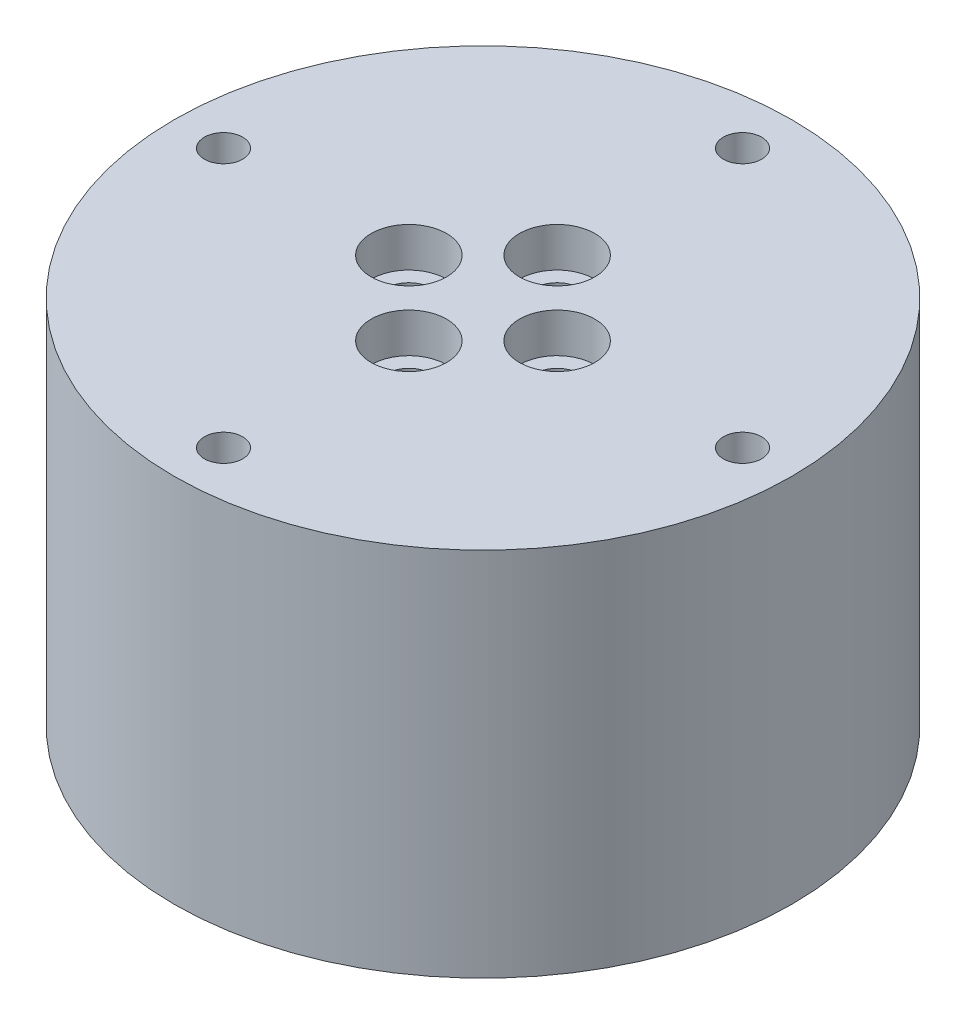
ISO-10303-21;
HEADER;
FILE_DESCRIPTION(('STEP AP214'),'2;1');
FILE_NAME('part.step','',(''),(''),'','','');
FILE_SCHEMA(('AUTOMOTIVE_DESIGN { 1 0 10303 214 1 1 1 1 }'));
ENDSEC;
DATA;
#1=APPLICATION_CONTEXT('core data for automotive mechanical design processes');
#2=APPLICATION_PROTOCOL_DEFINITION('international standard','automotive_design',2000,#1);
#3=PRODUCT_CONTEXT('',#1,'mechanical');
#4=PRODUCT('Part','Part','',(#3));
#5=PRODUCT_RELATED_PRODUCT_CATEGORY('part','',(#4));
#6=PRODUCT_DEFINITION_FORMATION('','',#4);
#7=PRODUCT_DEFINITION_CONTEXT('part definition',#1,'design');
#8=PRODUCT_DEFINITION('design','',#6,#7);
#9=PRODUCT_DEFINITION_SHAPE('','',#8);
#10=(LENGTH_UNIT() NAMED_UNIT(*) SI_UNIT(.MILLI.,.METRE.));
#11=(NAMED_UNIT(*) PLANE_ANGLE_UNIT() SI_UNIT($,.RADIAN.));
#12=(NAMED_UNIT(*) SI_UNIT($,.STERADIAN.) SOLID_ANGLE_UNIT());
#13=UNCERTAINTY_MEASURE_WITH_UNIT(LENGTH_MEASURE(1.E-05),#10,'distance_accuracy_value','');
#14=(GEOMETRIC_REPRESENTATION_CONTEXT(3) GLOBAL_UNCERTAINTY_ASSIGNED_CONTEXT((#13)) GLOBAL_UNIT_ASSIGNED_CONTEXT((#10,
#11,#12)) REPRESENTATION_CONTEXT('',''));
#15=CARTESIAN_POINT('',(0.,0.,0.));
#16=DIRECTION('',(0.,0.,1.));
#17=DIRECTION('',(1.,0.,0.));
#18=AXIS2_PLACEMENT_3D('',#15,#16,#17);
#19=CARTESIAN_POINT('',(0.,-5.,0.));
#20=DIRECTION('',(0.,1.,0.));
#21=DIRECTION('',(0.,0.,1.));
#22=AXIS2_PLACEMENT_3D('',#19,#20,#21);
#23=CYLINDRICAL_SURFACE('',#22,25.);
#24=CARTESIAN_POINT('',(0.,0.,0.));
#25=DIRECTION('',(0.,1.,0.));
#26=DIRECTION('',(0.,0.,1.));
#27=AXIS2_PLACEMENT_3D('',#24,#25,#26);
#28=CIRCLE('',#27,25.);
#29=CARTESIAN_POINT('',(0.,0.,25.));
#30=VERTEX_POINT('',#29);
#31=EDGE_CURVE('E66',#30,#30,#28,.T.);
#32=ORIENTED_EDGE('',*,*,#31,.F.);
#33=EDGE_LOOP('',(#32));
#34=FACE_BOUND('',#33,.T.);
#35=CARTESIAN_POINT('',(0.,-30.,0.));
#36=DIRECTION('',(0.,-1.,0.));
#37=DIRECTION('',(0.,0.,-1.));
#38=AXIS2_PLACEMENT_3D('',#35,#36,#37);
#39=CIRCLE('',#38,25.);
#40=CARTESIAN_POINT('',(0.,-30.,-25.));
#41=VERTEX_POINT('',#40);
#42=EDGE_CURVE('E70',#41,#41,#39,.T.);
#43=ORIENTED_EDGE('',*,*,#42,.F.);
#44=EDGE_LOOP('',(#43));
#45=FACE_BOUND('',#44,.T.);
#46=ADVANCED_FACE('F39',(#34,#45),#23,.T.);
#47=CARTESIAN_POINT('',(0.,0.,0.));
#48=DIRECTION('',(0.,1.,0.));
#49=DIRECTION('',(0.,0.,1.));
#50=AXIS2_PLACEMENT_3D('',#47,#48,#49);
#51=PLANE('',#50);
#52=CARTESIAN_POINT('',(21.,0.,0.));
#53=DIRECTION('',(0.,1.,0.));
#54=DIRECTION('',(-1.,0.,0.));
#55=AXIS2_PLACEMENT_3D('',#52,#53,#54);
#56=CIRCLE('',#55,1.55);
#57=CARTESIAN_POINT('',(19.45,0.,0.));
#58=VERTEX_POINT('',#57);
#59=EDGE_CURVE('E160',#58,#58,#56,.T.);
#60=ORIENTED_EDGE('',*,*,#59,.F.);
#61=EDGE_LOOP('',(#60));
#62=FACE_BOUND('',#61,.T.);
#63=CARTESIAN_POINT('',(0.,0.,21.));
#64=DIRECTION('',(0.,1.,0.));
#65=DIRECTION('',(0.,0.,-1.));
#66=AXIS2_PLACEMENT_3D('',#63,#64,#65);
#67=CIRCLE('',#66,1.55);
#68=CARTESIAN_POINT('',(0.,0.,19.45));
#69=VERTEX_POINT('',#68);
#70=EDGE_CURVE('E153',#69,#69,#67,.T.);
#71=ORIENTED_EDGE('',*,*,#70,.F.);
#72=EDGE_LOOP('',(#71));
#73=FACE_BOUND('',#72,.T.);
#74=CARTESIAN_POINT('',(-21.,0.,-2.19963324347117E-13));
#75=DIRECTION('',(0.,1.,0.));
#76=DIRECTION('',(1.,0.,0.));
#77=AXIS2_PLACEMENT_3D('',#74,#75,#76);
#78=CIRCLE('',#77,1.55);
#79=CARTESIAN_POINT('',(-19.45,0.,-2.03727936121497E-13));
#80=VERTEX_POINT('',#79);
#81=EDGE_CURVE('E146',#80,#80,#78,.T.);
#82=ORIENTED_EDGE('',*,*,#81,.F.);
#83=EDGE_LOOP('',(#82));
#84=FACE_BOUND('',#83,.T.);
#85=CARTESIAN_POINT('',(0.,0.,6.));
#86=DIRECTION('',(0.,1.,0.));
#87=DIRECTION('',(0.,0.,-1.));
#88=AXIS2_PLACEMENT_3D('',#85,#86,#87);
#89=CIRCLE('',#88,3.05);
#90=CARTESIAN_POINT('',(0.,0.,2.95));
#91=VERTEX_POINT('',#90);
#92=EDGE_CURVE('E106',#91,#91,#89,.T.);
#93=ORIENTED_EDGE('',*,*,#92,.F.);
#94=EDGE_LOOP('',(#93));
#95=FACE_BOUND('',#94,.T.);
#96=CARTESIAN_POINT('',(-6.,0.,0.));
#97=DIRECTION('',(0.,1.,0.));
#98=DIRECTION('',(1.,0.,0.));
#99=AXIS2_PLACEMENT_3D('',#96,#97,#98);
#100=CIRCLE('',#99,3.05);
#101=CARTESIAN_POINT('',(-2.95,0.,0.));
#102=VERTEX_POINT('',#101);
#103=EDGE_CURVE('E114',#102,#102,#100,.T.);
#104=ORIENTED_EDGE('',*,*,#103,.F.);
#105=EDGE_LOOP('',(#104));
#106=FACE_BOUND('',#105,.T.);
#107=CARTESIAN_POINT('',(6.,0.,0.));
#108=DIRECTION('',(0.,1.,0.));
#109=DIRECTION('',(-1.,0.,0.));
#110=AXIS2_PLACEMENT_3D('',#107,#108,#109);
#111=CIRCLE('',#110,3.05);
#112=CARTESIAN_POINT('',(2.95,0.,0.));
#113=VERTEX_POINT('',#112);
#114=EDGE_CURVE('E98',#113,#113,#111,.T.);
#115=ORIENTED_EDGE('',*,*,#114,.F.);
#116=EDGE_LOOP('',(#115));
#117=FACE_BOUND('',#116,.T.);
#118=CARTESIAN_POINT('',(0.,0.,-21.));
#119=DIRECTION('',(0.,1.,0.));
#120=DIRECTION('',(0.,0.,1.));
#121=AXIS2_PLACEMENT_3D('',#118,#119,#120);
#122=CIRCLE('',#121,1.55);
#123=CARTESIAN_POINT('',(0.,0.,-19.45));
#124=VERTEX_POINT('',#123);
#125=EDGE_CURVE('E90',#124,#124,#122,.T.);
#126=ORIENTED_EDGE('',*,*,#125,.F.);
#127=EDGE_LOOP('',(#126));
#128=FACE_BOUND('',#127,.T.);
#129=CARTESIAN_POINT('',(0.,0.,-6.));
#130=DIRECTION('',(0.,1.,0.));
#131=DIRECTION('',(0.,0.,1.));
#132=AXIS2_PLACEMENT_3D('',#129,#130,#131);
#133=CIRCLE('',#132,3.05);
#134=CARTESIAN_POINT('',(0.,0.,-2.95));
#135=VERTEX_POINT('',#134);
#136=EDGE_CURVE('E75',#135,#135,#133,.T.);
#137=ORIENTED_EDGE('',*,*,#136,.F.);
#138=EDGE_LOOP('',(#137));
#139=FACE_BOUND('',#138,.T.);
#140=ORIENTED_EDGE('',*,*,#31,.T.);
#141=EDGE_LOOP('',(#140));
#142=FACE_BOUND('',#141,.T.);
#143=ADVANCED_FACE('F177',(#62,#73,#84,#95,#106,#117,#128,#139,#142),#51,.T.);
#144=CARTESIAN_POINT('',(0.,-30.,0.));
#145=DIRECTION('',(0.,-1.,0.));
#146=DIRECTION('',(0.,0.,-1.));
#147=AXIS2_PLACEMENT_3D('',#144,#145,#146);
#148=PLANE('',#147);
#149=CARTESIAN_POINT('',(0.,-30.,0.));
#150=DIRECTION('',(0.,-1.,0.));
#151=DIRECTION('',(0.,0.,-1.));
#152=AXIS2_PLACEMENT_3D('',#149,#150,#151);
#153=CIRCLE('',#152,24.5);
#154=CARTESIAN_POINT('',(0.,-30.,-24.5));
#155=VERTEX_POINT('',#154);
#156=EDGE_CURVE('E54',#155,#155,#153,.F.);
#157=ORIENTED_EDGE('',*,*,#156,.T.);
#158=EDGE_LOOP('',(#157));
#159=FACE_BOUND('',#158,.T.);
#160=ORIENTED_EDGE('',*,*,#42,.T.);
#161=EDGE_LOOP('',(#160));
#162=FACE_BOUND('',#161,.T.);
#163=ADVANCED_FACE('F180',(#159,#162),#148,.T.);
#164=CARTESIAN_POINT('',(0.,-30.,0.));
#165=DIRECTION('',(0.,1.,0.));
#166=DIRECTION('',(0.,0.,1.));
#167=AXIS2_PLACEMENT_3D('',#164,#165,#166);
#168=CYLINDRICAL_SURFACE('',#167,15.5);
#169=CARTESIAN_POINT('',(0.,-7.,0.));
#170=DIRECTION('',(0.,1.,0.));
#171=DIRECTION('',(0.,0.,1.));
#172=AXIS2_PLACEMENT_3D('',#169,#170,#171);
#173=CIRCLE('',#172,15.5);
#174=CARTESIAN_POINT('',(0.,-7.,15.5));
#175=VERTEX_POINT('',#174);
#176=EDGE_CURVE('E10',#175,#175,#173,.T.);
#177=ORIENTED_EDGE('',*,*,#176,.T.);
#178=EDGE_LOOP('',(#177));
#179=FACE_BOUND('',#178,.T.);
#180=CARTESIAN_POINT('',(0.,-21.,0.));
#181=DIRECTION('',(0.,-1.,0.));
#182=DIRECTION('',(0.,0.,-1.));
#183=AXIS2_PLACEMENT_3D('',#180,#181,#182);
#184=CIRCLE('',#183,15.5);
#185=CARTESIAN_POINT('',(0.,-21.,-15.5));
#186=VERTEX_POINT('',#185);
#187=EDGE_CURVE('E60',#186,#186,#184,.T.);
#188=ORIENTED_EDGE('',*,*,#187,.T.);
#189=EDGE_LOOP('',(#188));
#190=FACE_BOUND('',#189,.T.);
#191=ADVANCED_FACE('F204',(#179,#190),#168,.F.);
#192=CARTESIAN_POINT('',(0.,-5.,0.));
#193=DIRECTION('',(0.,1.,0.));
#194=DIRECTION('',(0.,0.,1.));
#195=AXIS2_PLACEMENT_3D('',#192,#193,#194);
#196=PLANE('',#195);
#197=CARTESIAN_POINT('',(0.,-5.,0.));
#198=DIRECTION('',(0.,1.,0.));
#199=DIRECTION('',(0.,0.,1.));
#200=AXIS2_PLACEMENT_3D('',#197,#198,#199);
#201=CIRCLE('',#200,13.5);
#202=CARTESIAN_POINT('',(0.,-5.,13.5));
#203=VERTEX_POINT('',#202);
#204=EDGE_CURVE('E47',#203,#203,#201,.F.);
#205=ORIENTED_EDGE('',*,*,#204,.T.);
#206=EDGE_LOOP('',(#205));
#207=FACE_BOUND('',#206,.T.);
#208=CARTESIAN_POINT('',(6.,-5.,0.));
#209=DIRECTION('',(0.,1.,0.));
#210=DIRECTION('',(0.,0.,1.));
#211=AXIS2_PLACEMENT_3D('',#208,#209,#210);
#212=CIRCLE('',#211,1.8);
#213=CARTESIAN_POINT('',(6.,-5.,1.80000000000002));
#214=VERTEX_POINT('',#213);
#215=EDGE_CURVE('E118',#214,#214,#212,.F.);
#216=ORIENTED_EDGE('',*,*,#215,.F.);
#217=EDGE_LOOP('',(#216));
#218=FACE_BOUND('',#217,.T.);
#219=CARTESIAN_POINT('',(0.,-5.,6.));
#220=DIRECTION('',(0.,1.,0.));
#221=DIRECTION('',(0.,0.,1.));
#222=AXIS2_PLACEMENT_3D('',#219,#220,#221);
#223=CIRCLE('',#222,1.8);
#224=CARTESIAN_POINT('',(0.,-5.,7.8));
#225=VERTEX_POINT('',#224);
#226=EDGE_CURVE('E132',#225,#225,#223,.F.);
#227=ORIENTED_EDGE('',*,*,#226,.F.);
#228=EDGE_LOOP('',(#227));
#229=FACE_BOUND('',#228,.T.);
#230=CARTESIAN_POINT('',(-6.,-5.,0.));
#231=DIRECTION('',(0.,1.,0.));
#232=DIRECTION('',(0.,0.,1.));
#233=AXIS2_PLACEMENT_3D('',#230,#231,#232);
#234=CIRCLE('',#233,1.8);
#235=CARTESIAN_POINT('',(-6.,-5.,1.79999999999994));
#236=VERTEX_POINT('',#235);
#237=EDGE_CURVE('E122',#236,#236,#234,.F.);
#238=ORIENTED_EDGE('',*,*,#237,.F.);
#239=EDGE_LOOP('',(#238));
#240=FACE_BOUND('',#239,.T.);
#241=CARTESIAN_POINT('',(0.,-5.,-6.));
#242=DIRECTION('',(0.,1.,0.));
#243=DIRECTION('',(0.,0.,1.));
#244=AXIS2_PLACEMENT_3D('',#241,#242,#243);
#245=CIRCLE('',#244,1.8);
#246=CARTESIAN_POINT('',(0.,-5.,-4.2));
#247=VERTEX_POINT('',#246);
#248=EDGE_CURVE('E78',#247,#247,#245,.F.);
#249=ORIENTED_EDGE('',*,*,#248,.F.);
#250=EDGE_LOOP('',(#249));
#251=FACE_BOUND('',#250,.T.);
#252=ADVANCED_FACE('F210',(#207,#218,#229,#240,#251),#196,.F.);
#253=CARTESIAN_POINT('',(0.,-3.2,-6.));
#254=DIRECTION('',(0.,1.,0.));
#255=DIRECTION('',(0.,0.,1.));
#256=AXIS2_PLACEMENT_3D('',#253,#254,#255);
#257=CYLINDRICAL_SURFACE('',#256,3.05);
#258=CARTESIAN_POINT('',(0.,-3.2,-6.));
#259=DIRECTION('',(0.,1.,0.));
#260=DIRECTION('',(0.,0.,1.));
#261=AXIS2_PLACEMENT_3D('',#258,#259,#260);
#262=CIRCLE('',#261,3.05);
#263=CARTESIAN_POINT('',(0.,-3.2,-2.95));
#264=VERTEX_POINT('',#263);
#265=EDGE_CURVE('E74',#264,#264,#262,.T.);
#266=ORIENTED_EDGE('',*,*,#265,.F.);
#267=EDGE_LOOP('',(#266));
#268=FACE_BOUND('',#267,.T.);
#269=ORIENTED_EDGE('',*,*,#136,.T.);
#270=EDGE_LOOP('',(#269));
#271=FACE_BOUND('',#270,.T.);
#272=ADVANCED_FACE('F215',(#268,#271),#257,.F.);
#273=CARTESIAN_POINT('',(0.,-3.2,-6.));
#274=DIRECTION('',(0.,1.,0.));
#275=DIRECTION('',(0.,0.,1.));
#276=AXIS2_PLACEMENT_3D('',#273,#274,#275);
#277=PLANE('',#276);
#278=CARTESIAN_POINT('',(0.,-3.2,-6.));
#279=DIRECTION('',(0.,1.,0.));
#280=DIRECTION('',(0.,0.,1.));
#281=AXIS2_PLACEMENT_3D('',#278,#279,#280);
#282=CIRCLE('',#281,1.8);
#283=CARTESIAN_POINT('',(0.,-3.2,-4.2));
#284=VERTEX_POINT('',#283);
#285=EDGE_CURVE('E85',#284,#284,#282,.F.);
#286=ORIENTED_EDGE('',*,*,#285,.T.);
#287=EDGE_LOOP('',(#286));
#288=FACE_BOUND('',#287,.T.);
#289=ORIENTED_EDGE('',*,*,#265,.T.);
#290=EDGE_LOOP('',(#289));
#291=FACE_BOUND('',#290,.T.);
#292=ADVANCED_FACE('F294',(#288,#291),#277,.T.);
#293=CARTESIAN_POINT('',(0.,-30.001,-6.));
#294=DIRECTION('',(0.,1.,0.));
#295=DIRECTION('',(0.,0.,1.));
#296=AXIS2_PLACEMENT_3D('',#293,#294,#295);
#297=CYLINDRICAL_SURFACE('',#296,1.8);
#298=ORIENTED_EDGE('',*,*,#285,.F.);
#299=EDGE_LOOP('',(#298));
#300=FACE_BOUND('',#299,.T.);
#301=ORIENTED_EDGE('',*,*,#248,.T.);
#302=EDGE_LOOP('',(#301));
#303=FACE_BOUND('',#302,.T.);
#304=ADVANCED_FACE('F290',(#300,#303),#297,.F.);
#305=CARTESIAN_POINT('',(0.,-7.,-21.));
#306=DIRECTION('',(0.,1.,0.));
#307=DIRECTION('',(0.,0.,1.));
#308=AXIS2_PLACEMENT_3D('',#305,#306,#307);
#309=CYLINDRICAL_SURFACE('',#308,1.55);
#310=CARTESIAN_POINT('',(0.,-7.,-21.));
#311=DIRECTION('',(0.,1.,0.));
#312=DIRECTION('',(0.,0.,1.));
#313=AXIS2_PLACEMENT_3D('',#310,#311,#312);
#314=CIRCLE('',#313,1.55);
#315=CARTESIAN_POINT('',(0.,-7.,-19.45));
#316=VERTEX_POINT('',#315);
#317=EDGE_CURVE('E89',#316,#316,#314,.T.);
#318=ORIENTED_EDGE('',*,*,#317,.F.);
#319=EDGE_LOOP('',(#318));
#320=FACE_BOUND('',#319,.T.);
#321=ORIENTED_EDGE('',*,*,#125,.T.);
#322=EDGE_LOOP('',(#321));
#323=FACE_BOUND('',#322,.T.);
#324=ADVANCED_FACE('F286',(#320,#323),#309,.F.);
#325=CARTESIAN_POINT('',(0.,-7.,0.));
#326=DIRECTION('',(0.,1.,0.));
#327=DIRECTION('',(0.,0.,1.));
#328=AXIS2_PLACEMENT_3D('',#325,#326,#327);
#329=PLANE('',#328);
#330=ORIENTED_EDGE('',*,*,#317,.T.);
#331=EDGE_LOOP('',(#330));
#332=FACE_BOUND('',#331,.T.);
#333=ADVANCED_FACE('F282',(#332),#329,.T.);
#334=CARTESIAN_POINT('',(6.,-3.2,0.));
#335=DIRECTION('',(0.,1.,0.));
#336=DIRECTION('',(0.,0.,1.));
#337=AXIS2_PLACEMENT_3D('',#334,#335,#336);
#338=CYLINDRICAL_SURFACE('',#337,3.05);
#339=CARTESIAN_POINT('',(6.,-3.2,0.));
#340=DIRECTION('',(0.,1.,0.));
#341=DIRECTION('',(-1.,0.,0.));
#342=AXIS2_PLACEMENT_3D('',#339,#340,#341);
#343=CIRCLE('',#342,3.05);
#344=CARTESIAN_POINT('',(2.95,-3.2,0.));
#345=VERTEX_POINT('',#344);
#346=EDGE_CURVE('E94',#345,#345,#343,.T.);
#347=ORIENTED_EDGE('',*,*,#346,.F.);
#348=EDGE_LOOP('',(#347));
#349=FACE_BOUND('',#348,.T.);
#350=ORIENTED_EDGE('',*,*,#114,.T.);
#351=EDGE_LOOP('',(#350));
#352=FACE_BOUND('',#351,.T.);
#353=ADVANCED_FACE('F278',(#349,#352),#338,.F.);
#354=CARTESIAN_POINT('',(6.,-3.2,0.));
#355=DIRECTION('',(0.,1.,0.));
#356=DIRECTION('',(-1.,0.,0.));
#357=AXIS2_PLACEMENT_3D('',#354,#355,#356);
#358=PLANE('',#357);
#359=CARTESIAN_POINT('',(6.,-3.2,0.));
#360=DIRECTION('',(0.,1.,0.));
#361=DIRECTION('',(0.,0.,1.));
#362=AXIS2_PLACEMENT_3D('',#359,#360,#361);
#363=CIRCLE('',#362,1.8);
#364=CARTESIAN_POINT('',(6.,-3.2,1.80000000000002));
#365=VERTEX_POINT('',#364);
#366=EDGE_CURVE('E136',#365,#365,#363,.F.);
#367=ORIENTED_EDGE('',*,*,#366,.T.);
#368=EDGE_LOOP('',(#367));
#369=FACE_BOUND('',#368,.T.);
#370=ORIENTED_EDGE('',*,*,#346,.T.);
#371=EDGE_LOOP('',(#370));
#372=FACE_BOUND('',#371,.T.);
#373=ADVANCED_FACE('F268',(#369,#372),#358,.T.);
#374=CARTESIAN_POINT('',(-6.,-3.2,0.));
#375=DIRECTION('',(0.,1.,0.));
#376=DIRECTION('',(0.,0.,1.));
#377=AXIS2_PLACEMENT_3D('',#374,#375,#376);
#378=CYLINDRICAL_SURFACE('',#377,3.05);
#379=CARTESIAN_POINT('',(-6.,-3.2,0.));
#380=DIRECTION('',(0.,1.,0.));
#381=DIRECTION('',(1.,0.,0.));
#382=AXIS2_PLACEMENT_3D('',#379,#380,#381);
#383=CIRCLE('',#382,3.05);
#384=CARTESIAN_POINT('',(-2.95,-3.2,0.));
#385=VERTEX_POINT('',#384);
#386=EDGE_CURVE('E110',#385,#385,#383,.T.);
#387=ORIENTED_EDGE('',*,*,#386,.F.);
#388=EDGE_LOOP('',(#387));
#389=FACE_BOUND('',#388,.T.);
#390=ORIENTED_EDGE('',*,*,#103,.T.);
#391=EDGE_LOOP('',(#390));
#392=FACE_BOUND('',#391,.T.);
#393=ADVANCED_FACE('F264',(#389,#392),#378,.F.);
#394=CARTESIAN_POINT('',(-6.,-3.2,0.));
#395=DIRECTION('',(0.,1.,0.));
#396=DIRECTION('',(1.,0.,0.));
#397=AXIS2_PLACEMENT_3D('',#394,#395,#396);
#398=PLANE('',#397);
#399=CARTESIAN_POINT('',(-6.,-3.2,0.));
#400=DIRECTION('',(0.,1.,0.));
#401=DIRECTION('',(0.,0.,1.));
#402=AXIS2_PLACEMENT_3D('',#399,#400,#401);
#403=CIRCLE('',#402,1.8);
#404=CARTESIAN_POINT('',(-6.,-3.2,1.79999999999994));
#405=VERTEX_POINT('',#404);
#406=EDGE_CURVE('E127',#405,#405,#403,.F.);
#407=ORIENTED_EDGE('',*,*,#406,.T.);
#408=EDGE_LOOP('',(#407));
#409=FACE_BOUND('',#408,.T.);
#410=ORIENTED_EDGE('',*,*,#386,.T.);
#411=EDGE_LOOP('',(#410));
#412=FACE_BOUND('',#411,.T.);
#413=ADVANCED_FACE('F260',(#409,#412),#398,.T.);
#414=CARTESIAN_POINT('',(0.,-3.2,6.));
#415=DIRECTION('',(0.,1.,0.));
#416=DIRECTION('',(0.,0.,1.));
#417=AXIS2_PLACEMENT_3D('',#414,#415,#416);
#418=CYLINDRICAL_SURFACE('',#417,3.05);
#419=CARTESIAN_POINT('',(0.,-3.2,6.));
#420=DIRECTION('',(0.,1.,0.));
#421=DIRECTION('',(0.,0.,-1.));
#422=AXIS2_PLACEMENT_3D('',#419,#420,#421);
#423=CIRCLE('',#422,3.05);
#424=CARTESIAN_POINT('',(0.,-3.2,2.95));
#425=VERTEX_POINT('',#424);
#426=EDGE_CURVE('E102',#425,#425,#423,.T.);
#427=ORIENTED_EDGE('',*,*,#426,.F.);
#428=EDGE_LOOP('',(#427));
#429=FACE_BOUND('',#428,.T.);
#430=ORIENTED_EDGE('',*,*,#92,.T.);
#431=EDGE_LOOP('',(#430));
#432=FACE_BOUND('',#431,.T.);
#433=ADVANCED_FACE('F263',(#429,#432),#418,.F.);
#434=CARTESIAN_POINT('',(0.,-3.2,6.));
#435=DIRECTION('',(0.,1.,0.));
#436=DIRECTION('',(0.,0.,-1.));
#437=AXIS2_PLACEMENT_3D('',#434,#435,#436);
#438=PLANE('',#437);
#439=CARTESIAN_POINT('',(0.,-3.2,6.));
#440=DIRECTION('',(0.,1.,0.));
#441=DIRECTION('',(0.,0.,1.));
#442=AXIS2_PLACEMENT_3D('',#439,#440,#441);
#443=CIRCLE('',#442,1.8);
#444=CARTESIAN_POINT('',(0.,-3.2,7.8));
#445=VERTEX_POINT('',#444);
#446=EDGE_CURVE('E126',#445,#445,#443,.F.);
#447=ORIENTED_EDGE('',*,*,#446,.T.);
#448=EDGE_LOOP('',(#447));
#449=FACE_BOUND('',#448,.T.);
#450=ORIENTED_EDGE('',*,*,#426,.T.);
#451=EDGE_LOOP('',(#450));
#452=FACE_BOUND('',#451,.T.);
#453=ADVANCED_FACE('F255',(#449,#452),#438,.T.);
#454=CARTESIAN_POINT('',(0.,-30.001,6.));
#455=DIRECTION('',(0.,1.,0.));
#456=DIRECTION('',(0.,0.,1.));
#457=AXIS2_PLACEMENT_3D('',#454,#455,#456);
#458=CYLINDRICAL_SURFACE('',#457,1.8);
#459=ORIENTED_EDGE('',*,*,#446,.F.);
#460=EDGE_LOOP('',(#459));
#461=FACE_BOUND('',#460,.T.);
#462=ORIENTED_EDGE('',*,*,#226,.T.);
#463=EDGE_LOOP('',(#462));
#464=FACE_BOUND('',#463,.T.);
#465=ADVANCED_FACE('F252',(#461,#464),#458,.F.);
#466=CARTESIAN_POINT('',(-6.,-30.001,0.));
#467=DIRECTION('',(0.,1.,0.));
#468=DIRECTION('',(0.,0.,1.));
#469=AXIS2_PLACEMENT_3D('',#466,#467,#468);
#470=CYLINDRICAL_SURFACE('',#469,1.8);
#471=ORIENTED_EDGE('',*,*,#406,.F.);
#472=EDGE_LOOP('',(#471));
#473=FACE_BOUND('',#472,.T.);
#474=ORIENTED_EDGE('',*,*,#237,.T.);
#475=EDGE_LOOP('',(#474));
#476=FACE_BOUND('',#475,.T.);
#477=ADVANCED_FACE('F250',(#473,#476),#470,.F.);
#478=CARTESIAN_POINT('',(6.,-30.001,0.));
#479=DIRECTION('',(0.,1.,0.));
#480=DIRECTION('',(0.,0.,1.));
#481=AXIS2_PLACEMENT_3D('',#478,#479,#480);
#482=CYLINDRICAL_SURFACE('',#481,1.8);
#483=ORIENTED_EDGE('',*,*,#366,.F.);
#484=EDGE_LOOP('',(#483));
#485=FACE_BOUND('',#484,.T.);
#486=ORIENTED_EDGE('',*,*,#215,.T.);
#487=EDGE_LOOP('',(#486));
#488=FACE_BOUND('',#487,.T.);
#489=ADVANCED_FACE('F246',(#485,#488),#482,.F.);
#490=CARTESIAN_POINT('',(-21.,-7.,-2.19963324347117E-13));
#491=DIRECTION('',(0.,1.,0.));
#492=DIRECTION('',(0.,0.,1.));
#493=AXIS2_PLACEMENT_3D('',#490,#491,#492);
#494=CYLINDRICAL_SURFACE('',#493,1.55);
#495=CARTESIAN_POINT('',(-21.,-7.,-2.19963324347117E-13));
#496=DIRECTION('',(0.,1.,0.));
#497=DIRECTION('',(1.,0.,0.));
#498=AXIS2_PLACEMENT_3D('',#495,#496,#497);
#499=CIRCLE('',#498,1.55);
#500=CARTESIAN_POINT('',(-19.45,-7.,-2.03727936121497E-13));
#501=VERTEX_POINT('',#500);
#502=EDGE_CURVE('E150',#501,#501,#499,.T.);
#503=ORIENTED_EDGE('',*,*,#502,.F.);
#504=EDGE_LOOP('',(#503));
#505=FACE_BOUND('',#504,.T.);
#506=ORIENTED_EDGE('',*,*,#81,.T.);
#507=EDGE_LOOP('',(#506));
#508=FACE_BOUND('',#507,.T.);
#509=ADVANCED_FACE('F242',(#505,#508),#494,.F.);
#510=CARTESIAN_POINT('',(0.,-7.,0.));
#511=DIRECTION('',(0.,1.,0.));
#512=DIRECTION('',(1.,0.,0.));
#513=AXIS2_PLACEMENT_3D('',#510,#511,#512);
#514=PLANE('',#513);
#515=ORIENTED_EDGE('',*,*,#502,.T.);
#516=EDGE_LOOP('',(#515));
#517=FACE_BOUND('',#516,.T.);
#518=ADVANCED_FACE('F238',(#517),#514,.T.);
#519=CARTESIAN_POINT('',(0.,-7.,21.));
#520=DIRECTION('',(0.,1.,0.));
#521=DIRECTION('',(0.,0.,1.));
#522=AXIS2_PLACEMENT_3D('',#519,#520,#521);
#523=CYLINDRICAL_SURFACE('',#522,1.55);
#524=CARTESIAN_POINT('',(0.,-7.,21.));
#525=DIRECTION('',(0.,1.,0.));
#526=DIRECTION('',(0.,0.,-1.));
#527=AXIS2_PLACEMENT_3D('',#524,#525,#526);
#528=CIRCLE('',#527,1.55);
#529=CARTESIAN_POINT('',(0.,-7.,19.45));
#530=VERTEX_POINT('',#529);
#531=EDGE_CURVE('E156',#530,#530,#528,.T.);
#532=ORIENTED_EDGE('',*,*,#531,.F.);
#533=EDGE_LOOP('',(#532));
#534=FACE_BOUND('',#533,.T.);
#535=ORIENTED_EDGE('',*,*,#70,.T.);
#536=EDGE_LOOP('',(#535));
#537=FACE_BOUND('',#536,.T.);
#538=ADVANCED_FACE('F234',(#534,#537),#523,.F.);
#539=CARTESIAN_POINT('',(0.,-7.,0.));
#540=DIRECTION('',(0.,1.,0.));
#541=DIRECTION('',(0.,0.,-1.));
#542=AXIS2_PLACEMENT_3D('',#539,#540,#541);
#543=PLANE('',#542);
#544=ORIENTED_EDGE('',*,*,#531,.T.);
#545=EDGE_LOOP('',(#544));
#546=FACE_BOUND('',#545,.T.);
#547=ADVANCED_FACE('F173',(#546),#543,.T.);
#548=CARTESIAN_POINT('',(21.,-7.,0.));
#549=DIRECTION('',(0.,1.,0.));
#550=DIRECTION('',(0.,0.,1.));
#551=AXIS2_PLACEMENT_3D('',#548,#549,#550);
#552=CYLINDRICAL_SURFACE('',#551,1.55);
#553=CARTESIAN_POINT('',(21.,-7.,0.));
#554=DIRECTION('',(0.,1.,0.));
#555=DIRECTION('',(-1.,0.,0.));
#556=AXIS2_PLACEMENT_3D('',#553,#554,#555);
#557=CIRCLE('',#556,1.55);
#558=CARTESIAN_POINT('',(19.45,-7.,0.));
#559=VERTEX_POINT('',#558);
#560=EDGE_CURVE('E131',#559,#559,#557,.T.);
#561=ORIENTED_EDGE('',*,*,#560,.F.);
#562=EDGE_LOOP('',(#561));
#563=FACE_BOUND('',#562,.T.);
#564=ORIENTED_EDGE('',*,*,#59,.T.);
#565=EDGE_LOOP('',(#564));
#566=FACE_BOUND('',#565,.T.);
#567=ADVANCED_FACE('F170',(#563,#566),#552,.F.);
#568=CARTESIAN_POINT('',(0.,-7.,0.));
#569=DIRECTION('',(0.,1.,0.));
#570=DIRECTION('',(-1.,0.,0.));
#571=AXIS2_PLACEMENT_3D('',#568,#569,#570);
#572=PLANE('',#571);
#573=ORIENTED_EDGE('',*,*,#560,.T.);
#574=EDGE_LOOP('',(#573));
#575=FACE_BOUND('',#574,.T.);
#576=ADVANCED_FACE('F168',(#575),#572,.T.);
#577=CARTESIAN_POINT('',(0.,-21.,0.));
#578=DIRECTION('',(0.,-1.,0.));
#579=DIRECTION('',(0.,0.,-1.));
#580=AXIS2_PLACEMENT_3D('',#577,#578,#579);
#581=TOROIDAL_SURFACE('',#580,24.5,9.);
#582=ORIENTED_EDGE('',*,*,#156,.F.);
#583=EDGE_LOOP('',(#582));
#584=FACE_BOUND('',#583,.T.);
#585=ORIENTED_EDGE('',*,*,#187,.F.);
#586=EDGE_LOOP('',(#585));
#587=FACE_BOUND('',#586,.T.);
#588=ADVANCED_FACE('F216',(#584,#587),#581,.T.);
#589=CARTESIAN_POINT('',(0.,-7.,0.));
#590=DIRECTION('',(0.,1.,0.));
#591=DIRECTION('',(0.,0.,1.));
#592=AXIS2_PLACEMENT_3D('',#589,#590,#591);
#593=TOROIDAL_SURFACE('',#592,13.5,2.);
#594=ORIENTED_EDGE('',*,*,#176,.F.);
#595=EDGE_LOOP('',(#594));
#596=FACE_BOUND('',#595,.T.);
#597=ORIENTED_EDGE('',*,*,#204,.F.);
#598=EDGE_LOOP('',(#597));
#599=FACE_BOUND('',#598,.T.);
#600=ADVANCED_FACE('F41',(#596,#599),#593,.F.);
#601=CLOSED_SHELL('',(#46,#143,#163,#191,#252,#272,#292,#304,#324,#333,#353,#373,#393,#413,#433,
#453,#465,#477,#489,#509,#518,#538,#547,#567,#576,#588,#600));
#602=MANIFOLD_SOLID_BREP('B2',#601);
#603=ADVANCED_BREP_SHAPE_REPRESENTATION('',(#18,#602),#14);
#604=SHAPE_DEFINITION_REPRESENTATION(#9,#603);
ENDSEC;
END-ISO-10303-21;
